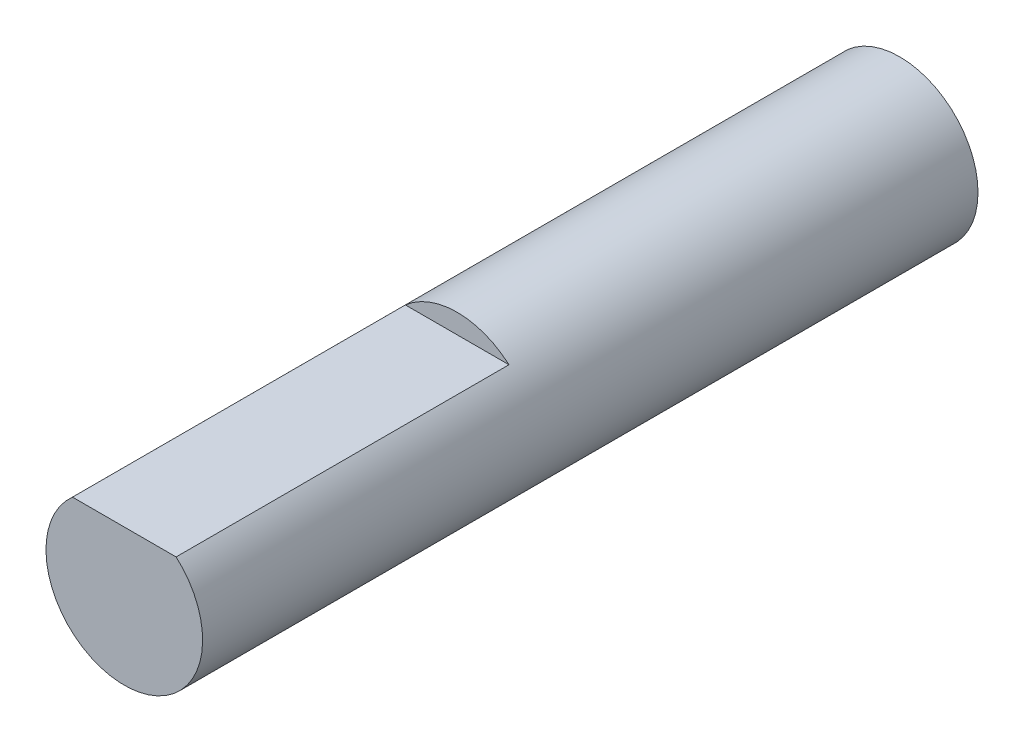
ISO-10303-21;
HEADER;
FILE_DESCRIPTION(('STEP AP214'),'2;1');
FILE_NAME('part.step','',(''),(''),'','','');
FILE_SCHEMA(('AUTOMOTIVE_DESIGN { 1 0 10303 214 1 1 1 1 }'));
ENDSEC;
DATA;
#1=APPLICATION_CONTEXT('core data for automotive mechanical design processes');
#2=APPLICATION_PROTOCOL_DEFINITION('international standard','automotive_design',2000,#1);
#3=PRODUCT_CONTEXT('',#1,'mechanical');
#4=PRODUCT('Part','Part','',(#3));
#5=PRODUCT_RELATED_PRODUCT_CATEGORY('part','',(#4));
#6=PRODUCT_DEFINITION_FORMATION('','',#4);
#7=PRODUCT_DEFINITION_CONTEXT('part definition',#1,'design');
#8=PRODUCT_DEFINITION('design','',#6,#7);
#9=PRODUCT_DEFINITION_SHAPE('','',#8);
#10=(LENGTH_UNIT() NAMED_UNIT(*) SI_UNIT(.MILLI.,.METRE.));
#11=(NAMED_UNIT(*) PLANE_ANGLE_UNIT() SI_UNIT($,.RADIAN.));
#12=(NAMED_UNIT(*) SI_UNIT($,.STERADIAN.) SOLID_ANGLE_UNIT());
#13=UNCERTAINTY_MEASURE_WITH_UNIT(LENGTH_MEASURE(1.E-05),#10,'distance_accuracy_value','');
#14=(GEOMETRIC_REPRESENTATION_CONTEXT(3) GLOBAL_UNCERTAINTY_ASSIGNED_CONTEXT((#13)) GLOBAL_UNIT_ASSIGNED_CONTEXT((#10,
#11,#12)) REPRESENTATION_CONTEXT('',''));
#15=CARTESIAN_POINT('',(0.,0.,0.));
#16=DIRECTION('',(0.,0.,1.));
#17=DIRECTION('',(1.,0.,0.));
#18=AXIS2_PLACEMENT_3D('',#15,#16,#17);
#19=CARTESIAN_POINT('',(0.,0.,19.8));
#20=DIRECTION('',(0.,0.,-1.));
#21=DIRECTION('',(-1.,0.,0.));
#22=AXIS2_PLACEMENT_3D('',#19,#20,#21);
#23=CYLINDRICAL_SURFACE('',#22,2.);
#24=CARTESIAN_POINT('',(0.,0.,0.));
#25=DIRECTION('',(0.,0.,1.));
#26=DIRECTION('',(1.,0.,0.));
#27=AXIS2_PLACEMENT_3D('',#24,#25,#26);
#28=CIRCLE('',#27,2.);
#29=CARTESIAN_POINT('',(2.,0.,0.));
#30=VERTEX_POINT('',#29);
#31=EDGE_CURVE('E42',#30,#30,#28,.T.);
#32=ORIENTED_EDGE('',*,*,#31,.T.);
#33=EDGE_LOOP('',(#32));
#34=FACE_BOUND('',#33,.T.);
#35=DIRECTION('',(0.,0.,-1.));
#36=VECTOR('',#35,1.);
#37=CARTESIAN_POINT('',(1.3228756555323,1.5,45.5402894311622));
#38=LINE('',#37,#36);
#39=CARTESIAN_POINT('',(1.3228756555323,1.5,19.8));
#40=VERTEX_POINT('',#39);
#41=CARTESIAN_POINT('',(1.3228756555323,1.5,11.3));
#42=VERTEX_POINT('',#41);
#43=EDGE_CURVE('E71',#40,#42,#38,.T.);
#44=ORIENTED_EDGE('',*,*,#43,.F.);
#45=CARTESIAN_POINT('',(0.,0.,19.8));
#46=DIRECTION('',(0.,0.,1.));
#47=DIRECTION('',(1.,0.,0.));
#48=AXIS2_PLACEMENT_3D('',#45,#46,#47);
#49=CIRCLE('',#48,2.);
#50=CARTESIAN_POINT('',(-1.3228756555323,1.5,19.8));
#51=VERTEX_POINT('',#50);
#52=EDGE_CURVE('E11',#51,#40,#49,.T.);
#53=ORIENTED_EDGE('',*,*,#52,.F.);
#54=DIRECTION('',(0.,0.,-1.));
#55=VECTOR('',#54,1.);
#56=CARTESIAN_POINT('',(-1.3228756555323,1.5,45.5402894311622));
#57=LINE('',#56,#55);
#58=CARTESIAN_POINT('',(-1.3228756555323,1.5,11.3));
#59=VERTEX_POINT('',#58);
#60=EDGE_CURVE('E54',#51,#59,#57,.T.);
#61=ORIENTED_EDGE('',*,*,#60,.T.);
#62=CARTESIAN_POINT('',(0.,0.,11.3));
#63=DIRECTION('',(0.,0.,1.));
#64=DIRECTION('',(1.,0.,0.));
#65=AXIS2_PLACEMENT_3D('',#62,#63,#64);
#66=CIRCLE('',#65,2.);
#67=EDGE_CURVE('E69',#42,#59,#66,.T.);
#68=ORIENTED_EDGE('',*,*,#67,.F.);
#69=EDGE_LOOP('',(#44,#53,#61,#68));
#70=FACE_BOUND('',#69,.T.);
#71=ADVANCED_FACE('F39',(#34,#70),#23,.T.);
#72=CARTESIAN_POINT('',(0.,0.,19.8));
#73=DIRECTION('',(0.,0.,1.));
#74=DIRECTION('',(1.,0.,0.));
#75=AXIS2_PLACEMENT_3D('',#72,#73,#74);
#76=PLANE('',#75);
#77=ORIENTED_EDGE('',*,*,#52,.T.);
#78=DIRECTION('',(1.,0.,0.));
#79=VECTOR('',#78,1.);
#80=CARTESIAN_POINT('',(-1.3228756555323,1.5,19.8));
#81=LINE('',#80,#79);
#82=EDGE_CURVE('E58',#51,#40,#81,.T.);
#83=ORIENTED_EDGE('',*,*,#82,.F.);
#84=EDGE_LOOP('',(#77,#83));
#85=FACE_BOUND('',#84,.T.);
#86=ADVANCED_FACE('F91',(#85),#76,.T.);
#87=CARTESIAN_POINT('',(0.,0.,0.));
#88=DIRECTION('',(0.,0.,1.));
#89=DIRECTION('',(1.,0.,0.));
#90=AXIS2_PLACEMENT_3D('',#87,#88,#89);
#91=PLANE('',#90);
#92=ORIENTED_EDGE('',*,*,#31,.F.);
#93=EDGE_LOOP('',(#92));
#94=FACE_BOUND('',#93,.T.);
#95=ADVANCED_FACE('F89',(#94),#91,.F.);
#96=CARTESIAN_POINT('',(-1.3228756555323,1.5,45.5402894311622));
#97=DIRECTION('',(0.,1.,0.));
#98=DIRECTION('',(0.,0.,1.));
#99=AXIS2_PLACEMENT_3D('',#96,#97,#98);
#100=PLANE('',#99);
#101=ORIENTED_EDGE('',*,*,#60,.F.);
#102=ORIENTED_EDGE('',*,*,#82,.T.);
#103=ORIENTED_EDGE('',*,*,#43,.T.);
#104=DIRECTION('',(1.,0.,0.));
#105=VECTOR('',#104,1.);
#106=CARTESIAN_POINT('',(-1.3228756555323,1.5,11.3));
#107=LINE('',#106,#105);
#108=EDGE_CURVE('E66',#59,#42,#107,.T.);
#109=ORIENTED_EDGE('',*,*,#108,.F.);
#110=EDGE_LOOP('',(#101,#102,#103,#109));
#111=FACE_BOUND('',#110,.T.);
#112=ADVANCED_FACE('F73',(#111),#100,.T.);
#113=CARTESIAN_POINT('',(0.,0.,11.3));
#114=DIRECTION('',(0.,0.,1.));
#115=DIRECTION('',(1.,0.,0.));
#116=AXIS2_PLACEMENT_3D('',#113,#114,#115);
#117=PLANE('',#116);
#118=ORIENTED_EDGE('',*,*,#108,.T.);
#119=ORIENTED_EDGE('',*,*,#67,.T.);
#120=EDGE_LOOP('',(#118,#119));
#121=FACE_BOUND('',#120,.T.);
#122=ADVANCED_FACE('F67',(#121),#117,.T.);
#123=CLOSED_SHELL('',(#71,#86,#95,#112,#122));
#124=MANIFOLD_SOLID_BREP('B2',#123);
#125=ADVANCED_BREP_SHAPE_REPRESENTATION('',(#18,#124),#14);
#126=SHAPE_DEFINITION_REPRESENTATION(#9,#125);
ENDSEC;
END-ISO-10303-21;
